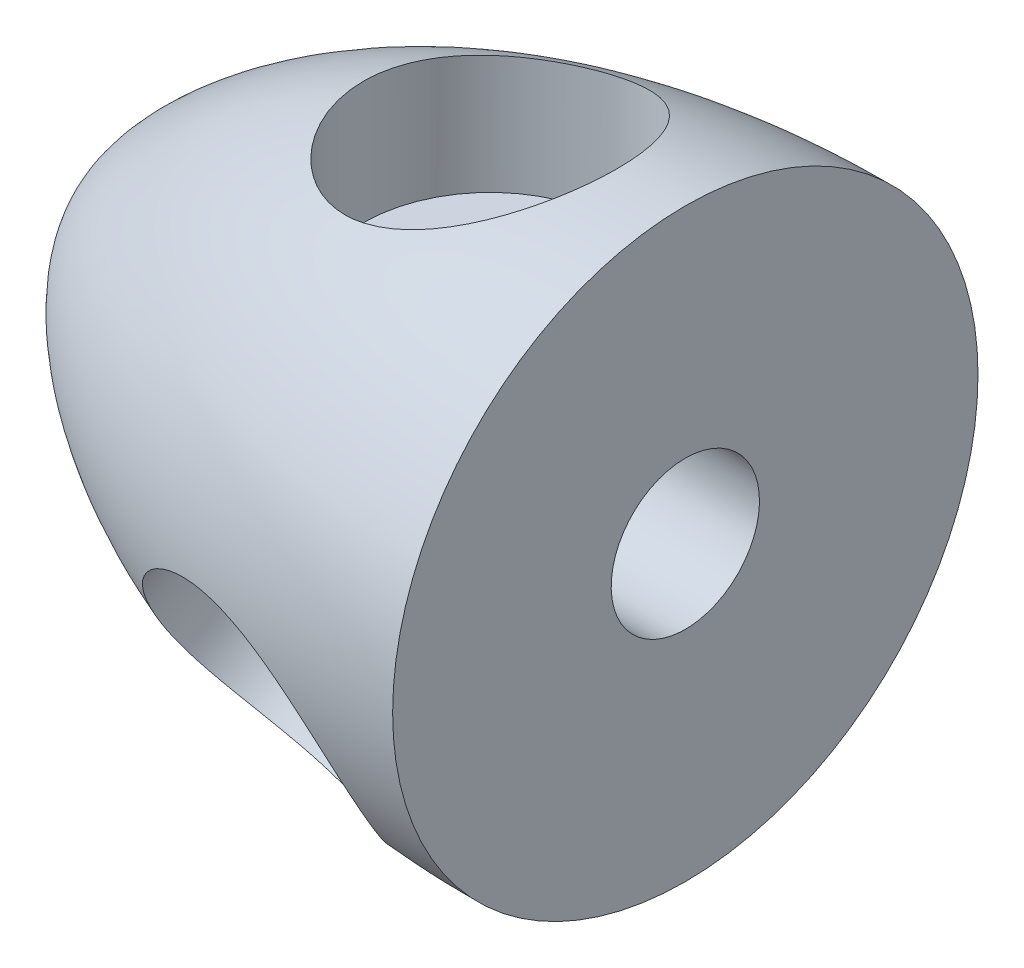
ISO-10303-21;
HEADER;
FILE_DESCRIPTION(('STEP AP214'),'2;1');
FILE_NAME('part.step','',(''),(''),'','','');
FILE_SCHEMA(('AUTOMOTIVE_DESIGN { 1 0 10303 214 1 1 1 1 }'));
ENDSEC;
DATA;
#1=APPLICATION_CONTEXT('core data for automotive mechanical design processes');
#2=APPLICATION_PROTOCOL_DEFINITION('international standard','automotive_design',2000,#1);
#3=PRODUCT_CONTEXT('',#1,'mechanical');
#4=PRODUCT('Part','Part','',(#3));
#5=PRODUCT_RELATED_PRODUCT_CATEGORY('part','',(#4));
#6=PRODUCT_DEFINITION_FORMATION('','',#4);
#7=PRODUCT_DEFINITION_CONTEXT('part definition',#1,'design');
#8=PRODUCT_DEFINITION('design','',#6,#7);
#9=PRODUCT_DEFINITION_SHAPE('','',#8);
#10=(LENGTH_UNIT() NAMED_UNIT(*) SI_UNIT(.MILLI.,.METRE.));
#11=(NAMED_UNIT(*) PLANE_ANGLE_UNIT() SI_UNIT($,.RADIAN.));
#12=(NAMED_UNIT(*) SI_UNIT($,.STERADIAN.) SOLID_ANGLE_UNIT());
#13=UNCERTAINTY_MEASURE_WITH_UNIT(LENGTH_MEASURE(1.E-05),#10,'distance_accuracy_value','');
#14=(GEOMETRIC_REPRESENTATION_CONTEXT(3) GLOBAL_UNCERTAINTY_ASSIGNED_CONTEXT((#13)) GLOBAL_UNIT_ASSIGNED_CONTEXT((#10,
#11,#12)) REPRESENTATION_CONTEXT('',''));
#15=CARTESIAN_POINT('',(0.,0.,0.));
#16=DIRECTION('',(0.,0.,1.));
#17=DIRECTION('',(1.,0.,0.));
#18=AXIS2_PLACEMENT_3D('',#15,#16,#17);
#19=CARTESIAN_POINT('',(0.,19.0500000000012,0.));
#20=CARTESIAN_POINT('',(-25.41,19.05,0.));
#21=CARTESIAN_POINT('',(-38.1,6.31666666666703,0.));
#22=CARTESIAN_POINT('',(-38.0999999999999,9.99200722162641E-13,0.));
#23=B_SPLINE_CURVE_WITH_KNOTS('',3,(#19,#20,#21,#22),.UNSPECIFIED.,.F.,.F.,(4,4),(0.,1.),.UNSPECIFIED.);
#24=CARTESIAN_POINT('',(0.,0.,0.));
#25=DIRECTION('',(1.,0.,0.));
#26=AXIS1_PLACEMENT('',#24,#25);
#27=SURFACE_OF_REVOLUTION('',#23,#26);
#28=CARTESIAN_POINT('',(-4.44500000000001,-9.45804617799617,16.3818165206235));
#29=CARTESIAN_POINT('',(-4.44500015064138,-9.27091519654826,16.4898565183917));
#30=CARTESIAN_POINT('',(-4.45349295522154,-9.08166766091949,16.5942355421234));
#31=CARTESIAN_POINT('',(-4.48736047476967,-8.7004214016924,16.7949134835629));
#32=CARTESIAN_POINT('',(-4.51273540002479,-8.50842264385346,16.8912123006051));
#33=CARTESIAN_POINT('',(-4.58006945896048,-8.1231496462918,17.0751618863486));
#34=CARTESIAN_POINT('',(-4.62203212616186,-7.92987514344122,17.1628108074744));
#35=CARTESIAN_POINT('',(-4.72205826379847,-7.54359727914573,17.3290286473111));
#36=CARTESIAN_POINT('',(-4.78012179030352,-7.3505939186474,17.4075975344002));
#37=CARTESIAN_POINT('',(-4.9115311197286,-6.96686715316216,17.5552101880287));
#38=CARTESIAN_POINT('',(-4.98483255345865,-6.7761387921417,17.6242806623933));
#39=CARTESIAN_POINT('',(-5.1460871324351,-6.39776467563141,17.7530936656805));
#40=CARTESIAN_POINT('',(-5.23404022095019,-6.21011890820884,17.812836230719));
#41=CARTESIAN_POINT('',(-5.42379490081363,-5.83918666210894,17.9230636609815));
#42=CARTESIAN_POINT('',(-5.52559570730404,-5.65589993706196,17.973549050501));
#43=CARTESIAN_POINT('',(-5.74225332795735,-5.29477608038795,18.0654742901383));
#44=CARTESIAN_POINT('',(-5.85711517467897,-5.11694108310611,18.1069106354801));
#45=CARTESIAN_POINT('',(-6.1053454161345,-4.75874289049157,18.182931272827));
#46=CARTESIAN_POINT('',(-6.23936664946179,-4.57873174657534,18.217045362668));
#47=CARTESIAN_POINT('',(-6.51995154640287,-4.22711831765983,18.2759689457253));
#48=CARTESIAN_POINT('',(-6.66651981102178,-4.05551915392863,18.3007750075757));
#49=CARTESIAN_POINT('',(-7.12359872561892,-3.55500968992728,18.3619113119326));
#50=CARTESIAN_POINT('',(-7.45162087673701,-3.2401897065755,18.3850001954523));
#51=CARTESIAN_POINT('',(-8.17985496598698,-2.62887020260287,18.400629367394));
#52=CARTESIAN_POINT('',(-8.58395898517171,-2.33690931780023,18.3900784498721));
#53=CARTESIAN_POINT('',(-9.21815712200873,-1.947698950637,18.350544957651));
#54=CARTESIAN_POINT('',(-9.43439404481089,-1.82601479463142,18.3333952807613));
#55=CARTESIAN_POINT('',(-9.87509355403064,-1.60008903435713,18.2918811048565));
#56=CARTESIAN_POINT('',(-10.0995527835617,-1.49584040640996,18.2675195220734));
#57=CARTESIAN_POINT('',(-10.5618609071371,-1.30330535203921,18.2114842391681));
#58=CARTESIAN_POINT('',(-10.7999088571543,-1.2155509710715,18.1796239802564));
#59=CARTESIAN_POINT('',(-11.2817417100073,-1.06104100821833,18.1097176756852));
#60=CARTESIAN_POINT('',(-11.5255240417092,-0.994276201076428,18.0716743587639));
#61=CARTESIAN_POINT('',(-12.0171307659768,-0.882889259018609,17.9900582918136));
#62=CARTESIAN_POINT('',(-12.264954028781,-0.838261041193929,17.946487064935));
#63=CARTESIAN_POINT('',(-12.762758223985,-0.772129307192009,17.8543949701456));
#64=CARTESIAN_POINT('',(-13.0127389638025,-0.75062374810978,17.8058745399156));
#65=CARTESIAN_POINT('',(-13.4960310767581,-0.732108514416318,17.7077636215655));
#66=CARTESIAN_POINT('',(-13.7293423396882,-0.733560873433298,17.6584602870194));
#67=CARTESIAN_POINT('',(-14.194093327426,-0.757566821073084,17.5562802924741));
#68=CARTESIAN_POINT('',(-14.4255331309278,-0.780119517731194,17.5034037836098));
#69=CARTESIAN_POINT('',(-14.884490616024,-0.846316353548636,17.3943025763769));
#70=CARTESIAN_POINT('',(-15.1120096410373,-0.889953113398031,17.3380790554767));
#71=CARTESIAN_POINT('',(-15.5612127620297,-0.997969601659725,17.2223592465344));
#72=CARTESIAN_POINT('',(-15.7828971051644,-1.06234844990773,17.162863097451));
#73=CARTESIAN_POINT('',(-16.2033746376248,-1.20599190434333,17.0448151211586));
#74=CARTESIAN_POINT('',(-16.4026894612292,-1.28391548793583,16.9864836620922));
#75=CARTESIAN_POINT('',(-16.7930856863612,-1.45632309745679,16.8668606280036));
#76=CARTESIAN_POINT('',(-16.9841675288754,-1.55080623502155,16.8055692119007));
#77=CARTESIAN_POINT('',(-17.3567322231473,-1.75534651725223,16.6798475063256));
#78=CARTESIAN_POINT('',(-17.5382144229241,-1.8654047178717,16.6154170042249));
#79=CARTESIAN_POINT('',(-17.890309240859,-2.09994416389083,16.4831948118098));
#80=CARTESIAN_POINT('',(-18.0609215789454,-2.22442578069001,16.4154030349691));
#81=CARTESIAN_POINT('',(-18.3913863475528,-2.48754684959384,16.2756767827332));
#82=CARTESIAN_POINT('',(-18.5511470939272,-2.62628676104388,16.2037147258324));
#83=CARTESIAN_POINT('',(-18.8574971658255,-2.91582389827507,16.0558258207199));
#84=CARTESIAN_POINT('',(-19.0040806059013,-3.06662645539032,15.9798972246151));
#85=CARTESIAN_POINT('',(-19.2830812756176,-3.37883589353541,15.8238507548588));
#86=CARTESIAN_POINT('',(-19.4154966594329,-3.54024415187333,15.7437323373735));
#87=CARTESIAN_POINT('',(-19.6652514859611,-3.87212389886682,15.5791542148311));
#88=CARTESIAN_POINT('',(-19.7825971611242,-4.04259159925765,15.4946963248357));
#89=CARTESIAN_POINT('',(-20.0054540661015,-4.39742435592024,15.318178058372));
#90=CARTESIAN_POINT('',(-20.1103918521493,-4.58206840694361,15.2259538055678));
#91=CARTESIAN_POINT('',(-20.3026418377118,-4.95792935434696,15.0366453165367));
#92=CARTESIAN_POINT('',(-20.3899536433146,-5.14914639751078,14.9395609717552));
#93=CARTESIAN_POINT('',(-20.5463296088185,-5.5365017758237,14.7406331882602));
#94=CARTESIAN_POINT('',(-20.6153940571947,-5.73264003311892,14.6387898248128));
#95=CARTESIAN_POINT('',(-20.734771311653,-6.1282010819664,14.4305915532092));
#96=CARTESIAN_POINT('',(-20.7850842677316,-6.32762384723198,14.324236681149));
#97=CARTESIAN_POINT('',(-20.8666686018481,-6.72857277370498,14.107191267698));
#98=CARTESIAN_POINT('',(-20.8978989088364,-6.93010252884776,13.9964919165699));
#99=CARTESIAN_POINT('',(-20.940907263956,-7.33326399762503,13.7715529420818));
#100=CARTESIAN_POINT('',(-20.9526852423562,-7.5348957116224,13.6573133060324));
#101=CARTESIAN_POINT('',(-20.9566967260985,-7.93673729818704,13.4260474242201));
#102=CARTESIAN_POINT('',(-20.9489311931396,-8.13694724023081,13.3090213158549));
#103=CARTESIAN_POINT('',(-20.9139183015301,-8.53453008101243,13.0730830631509));
#104=CARTESIAN_POINT('',(-20.8866710785033,-8.73190299949075,12.9541709319475));
#105=CARTESIAN_POINT('',(-20.8132940729264,-9.12044313565206,12.7167645860496));
#106=CARTESIAN_POINT('',(-20.7673656108476,-9.31165375808096,12.5982790985949));
#107=CARTESIAN_POINT('',(-20.6569828933475,-9.6888509311007,12.361628313286));
#108=CARTESIAN_POINT('',(-20.5925287601442,-9.87483751614677,12.2434630133245));
#109=CARTESIAN_POINT('',(-20.4455532657253,-10.2405714769516,12.0086815284333));
#110=CARTESIAN_POINT('',(-20.3630300556727,-10.4203182120639,11.8920655033222));
#111=CARTESIAN_POINT('',(-20.1804991902111,-10.7726412135588,11.6617198102237));
#112=CARTESIAN_POINT('',(-20.0804913406838,-10.9452174003062,11.5479901742977));
#113=CARTESIAN_POINT('',(-19.8627060122151,-11.2839043774029,11.3238130954277));
#114=CARTESIAN_POINT('',(-19.744777890609,-11.4499437085208,11.2134040102167));
#115=CARTESIAN_POINT('',(-19.4925649089392,-11.7732638030245,10.9983703973952));
#116=CARTESIAN_POINT('',(-19.3582725311354,-11.9305404921369,10.89374856078));
#117=CARTESIAN_POINT('',(-19.0742743837781,-12.2356293239645,10.6918452871486));
#118=CARTESIAN_POINT('',(-18.9245676902412,-12.3834408984479,10.5945642907723));
#119=CARTESIAN_POINT('',(-18.610844469357,-12.6689556808042,10.408902382752));
#120=CARTESIAN_POINT('',(-18.4468347951823,-12.806663672129,10.320517251973));
#121=CARTESIAN_POINT('',(-18.1052636830487,-13.0717901659123,10.1539080311));
#122=CARTESIAN_POINT('',(-17.927676936145,-13.1991884934935,10.0757036900389));
#123=CARTESIAN_POINT('',(-17.5605196939864,-13.442928101796,9.93105919836899));
#124=CARTESIAN_POINT('',(-17.3709491751156,-13.5592693607265,9.86461907094438));
#125=CARTESIAN_POINT('',(-16.9813281129981,-13.7804226889622,9.74479602428202));
#126=CARTESIAN_POINT('',(-16.7812808631909,-13.8852383496902,9.69140903125441));
#127=CARTESIAN_POINT('',(-16.3722429271608,-14.0829821135884,9.59875076199868));
#128=CARTESIAN_POINT('',(-16.1632525545809,-14.1759106331955,9.55947899119106));
#129=CARTESIAN_POINT('',(-15.7453007172321,-14.3465674639179,9.49697029216099));
#130=CARTESIAN_POINT('',(-15.5365815956366,-14.4247062387361,9.4732319477776));
#131=CARTESIAN_POINT('',(-15.114021683305,-14.5693028633445,9.44019354772077));
#132=CARTESIAN_POINT('',(-14.9001810203412,-14.6357610041991,9.43089313222982));
#133=CARTESIAN_POINT('',(-14.4690461224957,-14.756783267086,9.42694492532753));
#134=CARTESIAN_POINT('',(-14.2517521056408,-14.8113481368217,9.43229621250925));
#135=CARTESIAN_POINT('',(-13.8153354536472,-14.9084382610643,9.4575833873341));
#136=CARTESIAN_POINT('',(-13.5962128100326,-14.9509634597324,9.47751934261781));
#137=CARTESIAN_POINT('',(-13.1605691496248,-15.0234042157436,9.53129632939343));
#138=CARTESIAN_POINT('',(-12.9440513126238,-15.053476397171,9.56495336926101));
#139=CARTESIAN_POINT('',(-12.5121968988408,-15.1017520947654,9.64562612620604));
#140=CARTESIAN_POINT('',(-12.2968603056443,-15.1199557762728,9.69264165717302));
#141=CARTESIAN_POINT('',(-11.8686641134685,-15.1444823186695,9.79933560931498));
#142=CARTESIAN_POINT('',(-11.6558045878,-15.1508048288095,9.85901440427));
#143=CARTESIAN_POINT('',(-11.233677908874,-15.1515771760508,9.99023378954572));
#144=CARTESIAN_POINT('',(-11.0244121668816,-15.1460224518268,10.0617789272758));
#145=CARTESIAN_POINT('',(-10.5982329829628,-15.1223570634402,10.2204263517716));
#146=CARTESIAN_POINT('',(-10.3816103413817,-15.1035155615932,10.3082030232261));
#147=CARTESIAN_POINT('',(-9.95480454693141,-15.0525213606554,10.4949226311428));
#148=CARTESIAN_POINT('',(-9.74462384544612,-15.020363660203,10.593869752889));
#149=CARTESIAN_POINT('',(-9.12540366213247,-14.90392007834,10.9057111736962));
#150=CARTESIAN_POINT('',(-8.72745216734617,-14.7996508682317,11.1336941652255));
#151=CARTESIAN_POINT('',(-7.9401561230391,-14.5275273293755,11.6391488390151));
#152=CARTESIAN_POINT('',(-7.55386150630596,-14.3553763512253,11.9190850986017));
#153=CARTESIAN_POINT('',(-7.01501740365332,-14.0509679382437,12.3562883474143));
#154=CARTESIAN_POINT('',(-6.84206340926645,-13.9417098472729,12.5050148265873));
#155=CARTESIAN_POINT('',(-6.51092269081989,-13.7078535015912,12.8067219431345));
#156=CARTESIAN_POINT('',(-6.35272931990797,-13.5832622107558,12.9597006250267));
#157=CARTESIAN_POINT('',(-6.05232553404148,-13.3188696262139,13.2683898261292));
#158=CARTESIAN_POINT('',(-5.9101230807821,-13.1790608234551,13.4241016619331));
#159=CARTESIAN_POINT('',(-5.64319037033683,-12.8847184320576,13.7364325179549));
#160=CARTESIAN_POINT('',(-5.51845206412011,-12.7301916823032,13.8930510853795));
#161=CARTESIAN_POINT('',(-5.28780376423315,-12.4070670282233,14.2053971542461));
#162=CARTESIAN_POINT('',(-5.18188167305356,-12.2384782680103,14.3611251654581));
#163=CARTESIAN_POINT('',(-4.99007923779726,-11.8880324980337,14.6699565329968));
#164=CARTESIAN_POINT('',(-4.90419517383647,-11.7061779591868,14.8230603715806));
#165=CARTESIAN_POINT('',(-4.7658531307572,-11.360920137167,15.1002994546568));
#166=CARTESIAN_POINT('',(-4.71023234173758,-11.1993128887385,15.2251031499263));
#167=CARTESIAN_POINT('',(-4.6144393610873,-10.8685210402634,15.4705096453304));
#168=CARTESIAN_POINT('',(-4.5742651270914,-10.6993374452769,15.5911129989211));
#169=CARTESIAN_POINT('',(-4.50981515701819,-10.3544842382264,15.8270618149237));
#170=CARTESIAN_POINT('',(-4.48553409403636,-10.1788168202169,15.942409026961));
#171=CARTESIAN_POINT('',(-4.45312609844276,-9.82212357046954,16.1669442035897));
#172=CARTESIAN_POINT('',(-4.44499985264278,-9.64109751124458,16.2761319061218));
#173=CARTESIAN_POINT('',(-4.44500000000001,-9.45804617799617,16.3818165206235));
#174=B_SPLINE_CURVE_WITH_KNOTS('',3,(#28,#29,#30,#31,#32,#33,#34,#35,#36,#37,#38,#39,#40,#41,
#42,#43,#44,#45,#46,#47,#48,#49,#50,#51,#52,#53,#54,#55,#56,#57,#58,#59,#60,#61,#62,#63,#64,#65,
#66,#67,#68,#69,#70,#71,#72,#73,#74,#75,#76,#77,#78,#79,#80,#81,#82,#83,#84,#85,#86,#87,#88,#89,
#90,#91,#92,#93,#94,#95,#96,#97,#98,#99,#100,#101,#102,#103,#104,#105,#106,#107,#108,#109,#110,
#111,#112,#113,#114,#115,#116,#117,#118,#119,#120,#121,#122,#123,#124,#125,#126,#127,#128,#129,
#130,#131,#132,#133,#134,#135,#136,#137,#138,#139,#140,#141,#142,#143,#144,#145,#146,#147,#148,
#149,#150,#151,#152,#153,#154,#155,#156,#157,#158,#159,#160,#161,#162,#163,#164,#165,#166,#167,
#168,#169,#170,#171,#172,#173),.UNSPECIFIED.,.T.,.F.,(4,2,2,2,2,2,2,2,2,2,2,2,2,2,2,2,2,2,2,2,2,
2,2,2,2,2,2,2,2,2,2,2,2,2,2,2,2,2,2,2,2,2,2,2,2,2,2,2,2,2,2,2,2,2,2,2,2,2,2,2,2,2,2,2,2,2,2,2,2,
2,2,2,4),(0.,0.648037965160109,1.29608400256488,1.94426816119365,2.59245457709501,
3.23877941979629,3.8851017599822,4.53138748330386,5.17792307668567,5.85818570541619,
6.53869886434002,7.89900067392553,9.38777986307498,10.133231005912,10.8783811262419,
11.644510653493,12.4103029821674,13.1758847621895,13.9413988969029,14.6558614950964,
15.3702938925116,16.0844764233167,16.7986286526796,17.4632823101108,18.1279003220438,
18.7925634151599,19.4572436269968,20.1269781102167,20.7970102494557,21.4671295749722,
22.1369708573915,22.83077178957,23.5245882253452,24.2183936918191,24.9121936083026,
25.607481558928,26.30277200196,26.9980282317426,27.693279621472,28.3812290994271,
29.0691740389313,29.7571894022253,30.4452124045026,31.139376653854,31.8338610131525,
32.5283870263346,33.2225820716602,33.9181042863071,34.6136278716309,35.3089341111467,
36.0042159856371,36.6757734617708,37.3473142012924,38.0188127103582,38.6903143337103,
39.3530931188825,40.0158626706742,40.6786517880764,41.3416954882981,42.0443811946336,
42.7473310587455,44.1524876396915,45.66639780264,46.424402680831,47.1820645578807,
47.9401020113443,48.6977889355153,49.4549869429122,50.2120442710937,50.8462239118206,
51.4803196715638,52.1142027928383,52.7481128626744),.UNSPECIFIED.);
#175=CARTESIAN_POINT('',(-4.44500000000001,-9.45804617799617,16.3818165206235));
#176=VERTEX_POINT('',#175);
#177=EDGE_CURVE('E107',#176,#176,#174,.T.);
#178=ORIENTED_EDGE('',*,*,#177,.F.);
#179=EDGE_LOOP('',(#178));
#180=FACE_BOUND('',#179,.T.);
#181=CARTESIAN_POINT('',(-4.44499999999993,-9.45804617799595,-16.3818165206237));
#182=CARTESIAN_POINT('',(-4.44500015064126,-9.6451770514121,-16.2737763357388));
#183=CARTESIAN_POINT('',(-4.45349295522142,-9.83019570540029,-16.1620726741463));
#184=CARTESIAN_POINT('',(-4.48736047476953,-10.1946110302796,-15.9322426992774));
#185=CARTESIAN_POINT('',(-4.51273540002464,-10.3740076311122,-15.814116306015));
#186=CARTESIAN_POINT('',(-4.58006945896026,-10.7259491441626,-15.572434895606));
#187=CARTESIAN_POINT('',(-4.62203212616161,-10.8984925878971,-15.4488787267964));
#188=CARTESIAN_POINT('',(-4.72205826379833,-11.235580391906,-15.1974612033155));
#189=CARTESIAN_POINT('',(-4.78012179030352,-11.4001247243218,-15.0695998336532));
#190=CARTESIAN_POINT('',(-4.91153111972861,-11.7198244150268,-14.8110890334451));
#191=CARTESIAN_POINT('',(-4.98483255345851,-11.8750053809879,-14.6804486647611));
#192=CARTESIAN_POINT('',(-5.14608713243485,-12.1757477724274,-14.4171735693719));
#193=CARTESIAN_POINT('',(-5.23404022095,-12.3213092351494,-14.2845388503907));
#194=CARTESIAN_POINT('',(-5.42379490081343,-12.6022351130005,-14.0184158173167));
#195=CARTESIAN_POINT('',(-5.5255957073038,-12.7376001053679,-13.8849275520093));
#196=CARTESIAN_POINT('',(-5.74225332795719,-12.9977716264798,-13.6181477380357));
#197=CARTESIAN_POINT('',(-5.85711517467894,-13.1225740528267,-13.4848562853786));
#198=CARTESIAN_POINT('',(-6.10534541613446,-13.3675089522883,-13.2126578696583));
#199=CARTESIAN_POINT('',(-6.2393666494616,-13.4870581926757,-13.0738206909829));
#200=CARTESIAN_POINT('',(-6.51995154640247,-13.7138942269431,-12.798776320759));
#201=CARTESIAN_POINT('',(-6.66651981102131,-13.8211764885389,-12.6625701166248));
#202=CARTESIAN_POINT('',(-7.12359872561856,-14.1243768132059,-12.2596843581437));
#203=CARTESIAN_POINT('',(-7.45162087673707,-14.3017823645542,-11.9985866967022));
#204=CARTESIAN_POINT('',(-8.17985496598714,-14.6209773764822,-11.4769830624038));
#205=CARTESIAN_POINT('',(-8.58395898517147,-14.7578204562772,-11.2188620604921));
#206=CARTESIAN_POINT('',(-9.21815712200841,-14.9181886312953,-10.8620292490017));
#207=CARTESIAN_POINT('',(-9.43439404481061,-14.9641786534448,-10.7480728402179));
#208=CARTESIAN_POINT('',(-9.87509355403052,-15.0411892026313,-10.5316583044987));
#209=CARTESIAN_POINT('',(-10.0995527835617,-15.0722157670384,-10.4291955529955));
#210=CARTESIAN_POINT('',(-10.5618609071371,-15.1199553157196,-10.2344376633387));
#211=CARTESIAN_POINT('',(-10.7999088571543,-15.1362407126147,-10.1425100106713));
#212=CARTESIAN_POINT('',(-11.2817417100072,-15.1529550583979,-9.97374730541689));
#213=CARTESIAN_POINT('',(-11.5255240417091,-15.1533909830708,-9.89690562789269));
#214=CARTESIAN_POINT('',(-12.0171307659767,-15.1384028667637,-9.75963367294552));
#215=CARTESIAN_POINT('',(-12.2649540287809,-15.1229831863252,-9.6991988891443));
#216=CARTESIAN_POINT('',(-12.7627582239849,-15.0762949597508,-9.59588108010797));
#217=CARTESIAN_POINT('',(-13.0127389638024,-15.04502781411,-9.55299650450564));
#218=CARTESIAN_POINT('',(-13.4960310767581,-14.9693188832769,-9.48790638259497));
#219=CARTESIAN_POINT('',(-13.7293423396883,-14.9258947635603,-9.46451249512558));
#220=CARTESIAN_POINT('',(-14.1940933274261,-14.8254013187057,-9.43421225835064));
#221=CARTESIAN_POINT('',(-14.4255331309279,-14.7683325704367,-9.42730521214841));
#222=CARTESIAN_POINT('',(-14.8844906160241,-14.6407497354808,-9.43008275));
#223=CARTESIAN_POINT('',(-15.1120096410376,-14.5702403581665,-9.43976153211816));
#224=CARTESIAN_POINT('',(-15.5612127620298,-14.41601581977,-9.47544665050954));
#225=CARTESIAN_POINT('',(-15.7828971051642,-14.3323012191117,-9.50145229401745));
#226=CARTESIAN_POINT('',(-16.2033746376247,-14.1582469455593,-9.5668271864998));
#227=CARTESIAN_POINT('',(-16.4026894612294,-14.0687686283724,-9.60514525991125));
#228=CARTESIAN_POINT('',(-16.7930856863616,-13.8789682372139,-9.69464311251757));
#229=CARTESIAN_POINT('',(-16.9841675288757,-13.7786467450523,-9.74582220182658));
#230=CARTESIAN_POINT('',(-17.3567322231474,-13.5674984131017,-9.86009842954807));
#231=CARTESIAN_POINT('',(-17.5382144229242,-13.4566708611943,-9.92319637612893));
#232=CARTESIAN_POINT('',(-17.8903092408591,-13.2248933606093,-10.0602023983635));
#233=CARTESIAN_POINT('',(-18.0609215789454,-13.1039431512981,-10.1341107523955));
#234=CARTESIAN_POINT('',(-18.3913863475529,-12.8513761328342,-10.2921171562192));
#235=CARTESIAN_POINT('',(-18.5511470939273,-12.7196852077245,-10.3762884156032));
#236=CARTESIAN_POINT('',(-18.8574971658255,-12.4468410903435,-10.5530904792282));
#237=CARTESIAN_POINT('',(-19.0040806059014,-12.3056837186854,-10.6457250265934));
#238=CARTESIAN_POINT('',(-19.2830812756178,-12.014438792633,-10.8380830964501));
#239=CARTESIAN_POINT('',(-19.4154966594331,-11.8643500786106,-10.9378075398085));
#240=CARTESIAN_POINT('',(-19.6652514859612,-11.555881370085,-11.1429347704356));
#241=CARTESIAN_POINT('',(-19.7825971611241,-11.3975048416036,-11.2483351845016));
#242=CARTESIAN_POINT('',(-20.0054540661014,-11.0672191602828,-11.4673702326345));
#243=CARTESIAN_POINT('',(-20.1103918521495,-10.8950285889975,-11.5811645450758));
#244=CARTESIAN_POINT('',(-20.3026418377121,-10.5431521546427,-11.8120154293017));
#245=CARTESIAN_POINT('',(-20.3899536433148,-10.3634661241702,-11.9290720739274));
#246=CARTESIAN_POINT('',(-20.5463296088186,-9.99751192098865,-12.1650677800916));
#247=CARTESIAN_POINT('',(-20.6153940571948,-9.81124385238874,-12.2840068118395));
#248=CARTESIAN_POINT('',(-20.734771311653,-9.43315833573222,-12.5224735930871));
#249=CARTESIAN_POINT('',(-20.7850842677315,-9.24134093207895,-12.6420013378698));
#250=CARTESIAN_POINT('',(-20.866668601848,-8.85289962701893,-12.88071058709));
#251=CARTESIAN_POINT('',(-20.8978989088363,-8.65626629918821,-12.9998907990982));
#252=CARTESIAN_POINT('',(-20.940907263956,-8.25988269859165,-13.2365693856425));
#253=CARTESIAN_POINT('',(-20.9526852423562,-8.060132414655,-13.3540677541481));
#254=CARTESIAN_POINT('',(-20.9566967260984,-7.65892949269451,-13.586439835504));
#255=CARTESIAN_POINT('',(-20.9489311931394,-7.4574769389223,-13.7013136772215));
#256=CARTESIAN_POINT('',(-20.91391830153,-7.05435699796524,-13.9276613910952));
#257=CARTESIAN_POINT('',(-20.8866710785034,-6.85268961228572,-14.0391352869149));
#258=CARTESIAN_POINT('',(-20.8132940729264,-6.45281961763791,-14.2569177422714));
#259=CARTESIAN_POINT('',(-20.7673656108474,-6.25460286430806,-14.3632682550408));
#260=CARTESIAN_POINT('',(-20.6569828933472,-5.8610586858953,-14.571605196457));
#261=CARTESIAN_POINT('',(-20.592528760144,-5.66573124175991,-14.6735916538892));
#262=CARTESIAN_POINT('',(-20.4455532657252,-5.27953753110361,-14.8729358125272));
#263=CARTESIAN_POINT('',(-20.3630300556727,-5.08867172331299,-14.970293038826));
#264=CARTESIAN_POINT('',(-20.1804991902111,-4.71302500069016,-15.160240861909));
#265=CARTESIAN_POINT('',(-20.0804913406838,-4.52824415344159,-15.2528314057577));
#266=CARTESIAN_POINT('',(-19.8627060122151,-4.16475761964569,-15.4340543924193));
#267=CARTESIAN_POINT('',(-19.744777890609,-3.98612088148513,-15.5226441285892));
#268=CARTESIAN_POINT('',(-19.4925649089392,-3.63823626286212,-15.6951307375725));
#269=CARTESIAN_POINT('',(-19.3582725311353,-3.46899275000655,-15.7790254274594));
#270=CARTESIAN_POINT('',(-19.074274383778,-3.14159497002074,-15.9422884694173));
#271=CARTESIAN_POINT('',(-18.9245676902409,-2.98344136861171,-16.0216565497052));
#272=CARTESIAN_POINT('',(-18.6108444693568,-2.67989604857262,-16.1760886503716));
#273=CARTESIAN_POINT('',(-18.4468347951823,-2.53449828433859,-16.2511547037735));
#274=CARTESIAN_POINT('',(-18.1052636830486,-2.25764721966626,-16.3974563721697));
#275=CARTESIAN_POINT('',(-17.9276769361448,-2.12622110983075,-16.468684389724));
#276=CARTESIAN_POINT('',(-17.5605196939861,-1.87908550137605,-16.6074468365875));
#277=CARTESIAN_POINT('',(-17.3709491751154,-1.76337603373035,-16.6749812586173));
#278=CARTESIAN_POINT('',(-16.981328112998,-1.549029567244,-16.8065941356696));
#279=CARTESIAN_POINT('',(-16.7812808631907,-1.45038724468644,-16.8706736640606));
#280=CARTESIAN_POINT('',(-16.3722429271607,-1.27127094769126,-16.9955956524088));
#281=CARTESIAN_POINT('',(-16.1632525545809,-1.19079633671679,-17.0564382257214));
#282=CARTESIAN_POINT('',(-15.7453007172322,-1.05133380003805,-17.1729770269412));
#283=CARTESIAN_POINT('',(-15.5365815956365,-0.991706403349072,-17.2287780187622));
#284=CARTESIAN_POINT('',(-15.1140216833048,-0.89079599729519,-17.3374831689458));
#285=CARTESIAN_POINT('',(-14.900181020341,-0.84951253078695,-17.3903873994688));
#286=CARTESIAN_POINT('',(-14.4690461224956,-0.785582151866796,-17.4932216501013));
#287=CARTESIAN_POINT('',(-14.2517521056406,-0.762934067641329,-17.5431518570373));
#288=CARTESIAN_POINT('',(-13.8153354536471,-0.736288341308122,-17.6398779585005));
#289=CARTESIAN_POINT('',(-13.5962128100325,-0.732290785698182,-17.6866738384902));
#290=CARTESIAN_POINT('',(-13.1605691496247,-0.742642644379279,-17.776297866853));
#291=CARTESIAN_POINT('',(-12.9440513126237,-0.756754405207357,-17.8191696598499));
#292=CARTESIAN_POINT('',(-12.5121968988407,-0.802481213318067,-17.9013140188245));
#293=CARTESIAN_POINT('',(-12.2968603056443,-0.834096016754153,-17.9405866349358));
#294=CARTESIAN_POINT('',(-11.8686641134684,-0.914232418540785,-18.0151742197894));
#295=CARTESIAN_POINT('',(-11.6558045877999,-0.962754515969032,-18.0504890716637));
#296=CARTESIAN_POINT('',(-11.2336779088739,-1.07600766346638,-18.1167676366332));
#297=CARTESIAN_POINT('',(-11.0244121668816,-1.14074493237027,-18.1477296732094));
#298=CARTESIAN_POINT('',(-10.5982329829628,-1.28997032642198,-18.206558557924));
#299=CARTESIAN_POINT('',(-10.3816103413815,-1.37540790468427,-18.2341296744062));
#300=CARTESIAN_POINT('',(-9.95480454693113,-1.56260892899348,-18.2833272049066));
#301=CARTESIAN_POINT('',(-9.74462384544589,-1.66437850028333,-18.3049513802607));
#302=CARTESIAN_POINT('',(-9.12540366213236,-1.99266288358623,-18.3600289906634));
#303=CARTESIAN_POINT('',(-8.72745216734609,-2.24223655093544,-18.3837207016419));
#304=CARTESIAN_POINT('',(-7.9401561230391,-2.8160349083268,-18.4007821409195));
#305=CARTESIAN_POINT('',(-7.55386150630598,-3.14454230964424,-18.3916631503482));
#306=CARTESIAN_POINT('',(-7.01501740365347,-3.67537563622379,-18.3466393559868));
#307=CARTESIAN_POINT('',(-6.84206340926665,-3.85880559088844,-18.3263823132235));
#308=CARTESIAN_POINT('',(-6.51092269082003,-4.2370197911616,-18.2747103353007));
#309=CARTESIAN_POINT('',(-6.35272931990799,-4.43179886133524,-18.2433004532931));
#310=CARTESIAN_POINT('',(-6.05232553404151,-4.83132784363481,-18.1686743590588));
#311=CARTESIAN_POINT('',(-5.91012308078226,-5.03608265049044,-18.1254523020989));
#312=CARTESIAN_POINT('',(-5.64319037033708,-5.45374030188982,-18.0267097417489));
#313=CARTESIAN_POINT('',(-5.51845206412029,-5.66663933486107,-17.9711949346097));
#314=CARTESIAN_POINT('',(-5.28780376423329,-6.0987012923117,-17.8475338100208));
#315=CARTESIAN_POINT('',(-5.18188167305374,-6.31786008620865,-17.7793956664898));
#316=CARTESIAN_POINT('',(-4.99007923779733,-6.76053878097093,-17.6303164108106));
#317=CARTESIAN_POINT('',(-4.90419517383641,-6.98405786402482,-17.5493776796677));
#318=CARTESIAN_POINT('',(-4.76585313075716,-7.39678286390059,-17.3889951764814));
#319=CARTESIAN_POINT('',(-4.71023234173765,-7.58566965870426,-17.3114410415414));
#320=CARTESIAN_POINT('',(-4.61443936108744,-7.96359384221541,-17.1476701450993));
#321=CARTESIAN_POINT('',(-4.5742651270915,-8.15263120769981,-17.0614545307328));
#322=CARTESIAN_POINT('',(-4.50981515701826,-8.52939547987598,-16.8807773008518));
#323=CARTESIAN_POINT('',(-4.48553409403642,-8.71712280476067,-16.786318460257));
#324=CARTESIAN_POINT('',(-4.45312609844277,-9.08992259663803,-16.589680632932));
#325=CARTESIAN_POINT('',(-4.44499985264273,-9.27499495042421,-16.4875013181625));
#326=CARTESIAN_POINT('',(-4.44499999999993,-9.45804617799595,-16.3818165206237));
#327=B_SPLINE_CURVE_WITH_KNOTS('',3,(#181,#182,#183,#184,#185,#186,#187,#188,#189,#190,#191,
#192,#193,#194,#195,#196,#197,#198,#199,#200,#201,#202,#203,#204,#205,#206,#207,#208,#209,#210,
#211,#212,#213,#214,#215,#216,#217,#218,#219,#220,#221,#222,#223,#224,#225,#226,#227,#228,#229,
#230,#231,#232,#233,#234,#235,#236,#237,#238,#239,#240,#241,#242,#243,#244,#245,#246,#247,#248,
#249,#250,#251,#252,#253,#254,#255,#256,#257,#258,#259,#260,#261,#262,#263,#264,#265,#266,#267,
#268,#269,#270,#271,#272,#273,#274,#275,#276,#277,#278,#279,#280,#281,#282,#283,#284,#285,#286,
#287,#288,#289,#290,#291,#292,#293,#294,#295,#296,#297,#298,#299,#300,#301,#302,#303,#304,#305,
#306,#307,#308,#309,#310,#311,#312,#313,#314,#315,#316,#317,#318,#319,#320,#321,#322,#323,#324,
#325,#326),.UNSPECIFIED.,.T.,.F.,(4,2,2,2,2,2,2,2,2,2,2,2,2,2,2,2,2,2,2,2,2,2,2,2,2,2,2,2,2,2,2,
2,2,2,2,2,2,2,2,2,2,2,2,2,2,2,2,2,2,2,2,2,2,2,2,2,2,2,2,2,2,2,2,2,2,2,2,2,2,2,2,2,4),(0.,
0.648037965160295,1.29608400256528,1.94426816119427,2.59245457709584,3.23877941979718,
3.88510175998316,4.53138748330483,5.17792307668669,5.85818570541707,6.53869886434069,
7.89900067392597,9.38777986307578,10.1332310059128,10.8783811262429,11.644510653494,
12.4103029821684,13.1758847621904,13.9413988969039,14.6558614950975,15.3702938925127,
16.0844764233178,16.798628652681,17.4632823101122,18.127900322045,18.7925634151609,
19.4572436269978,20.1269781102177,20.7970102494569,21.4671295749735,22.136970857393,
22.8307717895715,23.5245882253466,24.2183936918205,24.9121936083039,25.6074815589295,
26.3027720019616,26.9980282317444,27.6932796214739,28.3812290994286,29.0691740389325,
29.7571894022261,30.4452124045032,31.1393766538548,31.8338610131535,32.5283870263358,
33.2225820716614,33.9181042863083,34.6136278716319,35.3089341111477,36.004215985638,
36.6757734617718,37.3473142012935,38.0188127103592,38.6903143337112,39.3530931188834,
40.0158626706752,40.6786517880774,41.3416954882992,42.0443811946348,42.7473310587465,
44.1524876396925,45.6663978026407,46.4244026808316,47.1820645578812,47.9401020113448,
48.6977889355158,49.4549869429127,50.2120442710943,50.8462239118209,51.480319671564,
52.1142027928382,52.7481128626741),.UNSPECIFIED.);
#328=CARTESIAN_POINT('',(-4.44499999999993,-9.45804617799595,-16.3818165206237));
#329=VERTEX_POINT('',#328);
#330=EDGE_CURVE('E95',#329,#329,#327,.T.);
#331=ORIENTED_EDGE('',*,*,#330,.F.);
#332=EDGE_LOOP('',(#331));
#333=FACE_BOUND('',#332,.T.);
#334=CARTESIAN_POINT('',(-4.44499999999997,18.9160923559953,0.));
#335=CARTESIAN_POINT('',(-4.44500015064132,18.9160922479635,-0.216080182653187));
#336=CARTESIAN_POINT('',(-4.45349295522143,18.9118633663225,-0.432162867977149));
#337=CARTESIAN_POINT('',(-4.48736047476952,18.8950324319745,-0.862670784285317));
#338=CARTESIAN_POINT('',(-4.51273540002464,18.8824302749681,-1.07709599459002));
#339=CARTESIAN_POINT('',(-4.58006945896024,18.8490987904568,-1.50272699074233));
#340=CARTESIAN_POINT('',(-4.62203212616154,18.8283677313407,-1.71393208067767));
#341=CARTESIAN_POINT('',(-4.72205826379831,18.7791776710538,-2.1315674439955));
#342=CARTESIAN_POINT('',(-4.7801217903036,18.750718642971,-2.33799770074735));
#343=CARTESIAN_POINT('',(-4.91153111972868,18.6866915681907,-2.74412115458395));
#344=CARTESIAN_POINT('',(-4.98483255345848,18.6511441731316,-2.94383199763229));
#345=CARTESIAN_POINT('',(-5.14608713243476,18.5735124480608,-3.33592009630845));
#346=CARTESIAN_POINT('',(-5.23404022094995,18.5314281433601,-3.5282973803283));
#347=CARTESIAN_POINT('',(-5.42379490081344,18.4414217751113,-3.90464784366496));
#348=CARTESIAN_POINT('',(-5.52559570730384,18.3935000424318,-4.08862149849197));
#349=CARTESIAN_POINT('',(-5.74225332795723,18.2925477068694,-4.4473265521029));
#350=CARTESIAN_POINT('',(-5.85711517467897,18.239515135934,-4.62205435010168));
#351=CARTESIAN_POINT('',(-6.10534541613453,18.126251842781,-4.97027340316898));
#352=CARTESIAN_POINT('',(-6.23936664946173,18.0657899392526,-5.14322467168542));
#353=CARTESIAN_POINT('',(-6.51995154640267,17.9410125446048,-5.47719262496675));
#354=CARTESIAN_POINT('',(-6.66651981102152,17.8766956424694,-5.63820489095125));
#355=CARTESIAN_POINT('',(-7.12359872561872,17.6793865031351,-6.10222695378911));
#356=CARTESIAN_POINT('',(-7.45162087673708,17.5419720711326,-6.38641349875024));
#357=CARTESIAN_POINT('',(-8.17985496598709,17.2498475790879,-6.92364630499033));
#358=CARTESIAN_POINT('',(-8.58395898517155,17.0947297740791,-7.1712163893803));
#359=CARTESIAN_POINT('',(-9.21815712200859,16.8658875819337,-7.48851570864967));
#360=CARTESIAN_POINT('',(-9.43439404481082,16.7901934480779,-7.58532244054378));
#361=CARTESIAN_POINT('',(-9.87509355403063,16.6412782369896,-7.76022280035798));
#362=CARTESIAN_POINT('',(-10.0995527835617,16.568056173449,-7.83832396907806));
#363=CARTESIAN_POINT('',(-10.5618609071371,16.4232606677593,-7.97704657582951));
#364=CARTESIAN_POINT('',(-10.7999088571544,16.3517916836873,-8.03711396958542));
#365=CARTESIAN_POINT('',(-11.2817417100074,16.2139960666177,-8.13597037026866));
#366=CARTESIAN_POINT('',(-11.5255240417093,16.1476671841486,-8.17476873087153));
#367=CARTESIAN_POINT('',(-12.0171307659769,16.0212921257836,-8.23042461886832));
#368=CARTESIAN_POINT('',(-12.2649540287811,15.9612442275204,-8.247288175791));
#369=CARTESIAN_POINT('',(-12.762758223985,15.8484242669441,-8.25851389003789));
#370=CARTESIAN_POINT('',(-13.0127389638024,15.795651562221,-8.25287803541009));
#371=CARTESIAN_POINT('',(-13.4960310767581,15.7014273976945,-8.21985723897061));
#372=CARTESIAN_POINT('',(-13.7293423396884,15.6594556369949,-8.19394779189397));
#373=CARTESIAN_POINT('',(-14.1940933274262,15.5829681397801,-8.12206803412373));
#374=CARTESIAN_POINT('',(-14.425533130928,15.5484520881691,-8.07609857146161));
#375=CARTESIAN_POINT('',(-14.8844906160242,15.4870660890306,-7.96421982637707));
#376=CARTESIAN_POINT('',(-15.1120096410376,15.4601934715656,-7.89831752335872));
#377=CARTESIAN_POINT('',(-15.5612127620298,15.4139854214312,-7.74691259602498));
#378=CARTESIAN_POINT('',(-15.7828971051643,15.3946496690213,-7.66141080343355));
#379=CARTESIAN_POINT('',(-16.2033746376248,15.3642388499045,-7.47798793465872));
#380=CARTESIAN_POINT('',(-16.4026894612294,15.3526841163097,-7.38133840218102));
#381=CARTESIAN_POINT('',(-16.7930856863615,15.3352913346719,-7.17221751548617));
#382=CARTESIAN_POINT('',(-16.9841675288757,15.3294529800751,-7.05974701007423));
#383=CARTESIAN_POINT('',(-17.3567322231475,15.3228449303553,-6.81974907677759));
#384=CARTESIAN_POINT('',(-17.5382144229243,15.3220755790674,-6.69222062809607));
#385=CARTESIAN_POINT('',(-17.8903092408591,15.3248375245012,-6.42299241344644));
#386=CARTESIAN_POINT('',(-18.0609215789454,15.3283689319886,-6.28129228257375));
#387=CARTESIAN_POINT('',(-18.3913863475529,15.3389229824285,-5.98355962651412));
#388=CARTESIAN_POINT('',(-18.5511470939274,15.3459719687694,-5.82742631022925));
#389=CARTESIAN_POINT('',(-18.8574971658257,15.36266498862,-5.50273534149172));
#390=CARTESIAN_POINT('',(-19.0040806059015,15.3723101740771,-5.33417219802182));
#391=CARTESIAN_POINT('',(-19.2830812756178,15.3932746861696,-4.98576765840868));
#392=CARTESIAN_POINT('',(-19.4154966594332,15.4045942304852,-4.80592479756474));
#393=CARTESIAN_POINT('',(-19.6652514859613,15.4280052689535,-4.43621944439545));
#394=CARTESIAN_POINT('',(-19.7825971611241,15.4400964408634,-4.24636114033439));
#395=CARTESIAN_POINT('',(-20.0054540661014,15.4646435162052,-3.85080782573783));
#396=CARTESIAN_POINT('',(-20.1103918521495,15.4770969959428,-3.64478926049199));
#397=CARTESIAN_POINT('',(-20.302641837712,15.5010815089911,-3.22462988723483));
#398=CARTESIAN_POINT('',(-20.3899536433147,15.5126125216826,-3.01048889782768));
#399=CARTESIAN_POINT('',(-20.5463296088185,15.5340136968139,-2.5755654081688));
#400=CARTESIAN_POINT('',(-20.6153940571946,15.5438838855091,-2.35478301297349));
#401=CARTESIAN_POINT('',(-20.734771311653,15.5613594177002,-1.90811796012234));
#402=CARTESIAN_POINT('',(-20.7850842677316,15.5689647793127,-1.68223534327941));
#403=CARTESIAN_POINT('',(-20.8666686018481,15.5814724007257,-1.22648068060823));
#404=CARTESIAN_POINT('',(-20.8978989088363,15.5863688280377,-0.996601117472005));
#405=CARTESIAN_POINT('',(-20.9409072639559,15.5931466962183,-0.534983556439699));
#406=CARTESIAN_POINT('',(-20.9526852423561,15.5950281262791,-0.303245551884615));
#407=CARTESIAN_POINT('',(-20.9566967260984,15.5956667908835,0.160392411283648));
#408=CARTESIAN_POINT('',(-20.9489311931394,15.5944241791551,0.392292361366416));
#409=CARTESIAN_POINT('',(-20.91391830153,15.5888870789795,0.8545783279442));
#410=CARTESIAN_POINT('',(-20.8866710785034,15.5845926117781,1.08496435496728));
#411=CARTESIAN_POINT('',(-20.8132940729265,15.5732627532915,1.54015315622179));
#412=CARTESIAN_POINT('',(-20.7673656108474,15.5662566223908,1.76498915644591));
#413=CARTESIAN_POINT('',(-20.6569828933472,15.5499096169977,2.20997688317106));
#414=CARTESIAN_POINT('',(-20.592528760144,15.5405687579082,2.43012864056478));
#415=CARTESIAN_POINT('',(-20.4455532657251,15.5201090080567,2.86425428409402));
#416=CARTESIAN_POINT('',(-20.3630300556725,15.5089899353784,3.07822753550401));
#417=CARTESIAN_POINT('',(-20.180499190211,15.4856662142499,3.49852105168538));
#418=CARTESIAN_POINT('',(-20.0804913406838,15.473461553748,3.70484123145984));
#419=CARTESIAN_POINT('',(-19.8627060122151,15.4486619970488,4.11024129699145));
#420=CARTESIAN_POINT('',(-19.7447778906089,15.4360645900069,4.30924011837251));
#421=CARTESIAN_POINT('',(-19.4925649089391,15.4115000658882,4.69676034017739));
#422=CARTESIAN_POINT('',(-19.3582725311353,15.3995332421449,4.88527686667942));
#423=CARTESIAN_POINT('',(-19.0742743837781,15.3772242939866,5.25044318226869));
#424=CARTESIAN_POINT('',(-18.9245676902411,15.3668822670611,5.42709225893285));
#425=CARTESIAN_POINT('',(-18.610844469357,15.3488517293783,5.7671862676196));
#426=CARTESIAN_POINT('',(-18.4468347951823,15.341161956469,5.9306374518005));
#427=CARTESIAN_POINT('',(-18.1052636830486,15.3294373855799,6.24354834106962));
#428=CARTESIAN_POINT('',(-17.9276769361449,15.3254096033257,6.39298069968512));
#429=CARTESIAN_POINT('',(-17.5605196939863,15.3220136031736,6.67638763821855));
#430=CARTESIAN_POINT('',(-17.3709491751154,15.3226453944584,6.81036218767302));
#431=CARTESIAN_POINT('',(-16.9813281129979,15.3294522562077,7.06179811138775));
#432=CARTESIAN_POINT('',(-16.7812808631906,15.3356255943781,7.17926463280633));
#433=CARTESIAN_POINT('',(-16.3722429271607,15.3542530612813,7.39684489041028));
#434=CARTESIAN_POINT('',(-16.1632525545809,15.3667069699142,7.49695923453032));
#435=CARTESIAN_POINT('',(-15.7453007172322,15.3979012639578,7.67600673478023));
#436=CARTESIAN_POINT('',(-15.5365815956365,15.4164126420868,7.75554607098468));
#437=CARTESIAN_POINT('',(-15.1140216833048,15.4600988606412,7.89728962122515));
#438=CARTESIAN_POINT('',(-14.9001810203411,15.4852735349877,7.95949426723914));
#439=CARTESIAN_POINT('',(-14.4690461224956,15.5423654189544,8.06627672477388));
#440=CARTESIAN_POINT('',(-14.2517521056406,15.5742822044645,8.1108556445283));
#441=CARTESIAN_POINT('',(-13.8153354536471,15.6447266023741,8.18229457116646));
#442=CARTESIAN_POINT('',(-13.5962128100325,15.6832542454327,8.20915449587219));
#443=CARTESIAN_POINT('',(-13.1605691496247,15.766046860125,8.2450015374594));
#444=CARTESIAN_POINT('',(-12.9440513126237,15.8102308023801,8.25421629058896));
#445=CARTESIAN_POINT('',(-12.5121968988407,15.904233308085,8.25568789261868));
#446=CARTESIAN_POINT('',(-12.2968603056442,15.9540517930285,8.24794497776295));
#447=CARTESIAN_POINT('',(-11.8686641134684,16.058714737212,8.21583861047451));
#448=CARTESIAN_POINT('',(-11.6558045877999,16.1135593447802,8.19147466739389));
#449=CARTESIAN_POINT('',(-11.2336779088739,16.2275848395187,8.12653384708759));
#450=CARTESIAN_POINT('',(-11.0244121668815,16.2867673841983,8.08595074593351));
#451=CARTESIAN_POINT('',(-10.5982329829628,16.4123273898633,7.98613220615233));
#452=CARTESIAN_POINT('',(-10.3816103413817,16.478923466279,7.92592665118025));
#453=CARTESIAN_POINT('',(-9.95480454693133,16.6151302896506,7.78840457376406));
#454=CARTESIAN_POINT('',(-9.74462384544605,16.6847421604879,7.71108162737189));
#455=CARTESIAN_POINT('',(-9.12540366213244,16.8965829619278,7.45431781696727));
#456=CARTESIAN_POINT('',(-8.72745216734617,17.0418874191688,7.25002653641624));
#457=CARTESIAN_POINT('',(-7.9401561230391,17.3435622377041,6.76163330190422));
#458=CARTESIAN_POINT('',(-7.5538615063059,17.4999186608713,6.47257805174655));
#459=CARTESIAN_POINT('',(-7.01501740365326,17.7263435744694,5.99035100857256));
#460=CARTESIAN_POINT('',(-6.8420634092664,17.8005154381632,5.82136748663633));
#461=CARTESIAN_POINT('',(-6.51092269081986,17.9448732927548,5.46798839216616));
#462=CARTESIAN_POINT('',(-6.35272931990793,18.0150610720931,5.28359982826633));
#463=CARTESIAN_POINT('',(-6.05232553404144,18.1501974698507,4.90028453292955));
#464=CARTESIAN_POINT('',(-5.91012308078206,18.2151434739476,4.70135064016581));
#465=CARTESIAN_POINT('',(-5.64319037033681,18.3384587339495,4.29027722379406));
#466=CARTESIAN_POINT('',(-5.51845206412008,18.3968310171663,4.07814384923019));
#467=CARTESIAN_POINT('',(-5.28780376423311,18.505768320537,3.64213665577463));
#468=CARTESIAN_POINT('',(-5.18188167305353,18.5563383542211,3.41827050103168));
#469=CARTESIAN_POINT('',(-4.99007923779721,18.6485712790066,2.96035987781375));
#470=CARTESIAN_POINT('',(-4.9041951738364,18.6902358232134,2.72631730808693));
#471=CARTESIAN_POINT('',(-4.76585313075714,18.7577030010694,2.28869572182437));
#472=CARTESIAN_POINT('',(-4.71023234173754,18.7849825474449,2.08633789161501));
#473=CARTESIAN_POINT('',(-4.61443936108727,18.8321148824812,1.6771604997688));
#474=CARTESIAN_POINT('',(-4.57426512709138,18.8519686529791,1.47034153181155));
#475=CARTESIAN_POINT('',(-4.50981515701816,18.8838797181048,1.05371548592812));
#476=CARTESIAN_POINT('',(-4.48553409403632,18.8959396249799,0.843909433296059));
#477=CARTESIAN_POINT('',(-4.45312609844272,18.9120461671103,0.422736429342214));
#478=CARTESIAN_POINT('',(-4.44499985264276,18.9160924616719,0.211369412040432));
#479=CARTESIAN_POINT('',(-4.44499999999997,18.9160923559953,0.));
#480=B_SPLINE_CURVE_WITH_KNOTS('',3,(#334,#335,#336,#337,#338,#339,#340,#341,#342,#343,#344,
#345,#346,#347,#348,#349,#350,#351,#352,#353,#354,#355,#356,#357,#358,#359,#360,#361,#362,#363,
#364,#365,#366,#367,#368,#369,#370,#371,#372,#373,#374,#375,#376,#377,#378,#379,#380,#381,#382,
#383,#384,#385,#386,#387,#388,#389,#390,#391,#392,#393,#394,#395,#396,#397,#398,#399,#400,#401,
#402,#403,#404,#405,#406,#407,#408,#409,#410,#411,#412,#413,#414,#415,#416,#417,#418,#419,#420,
#421,#422,#423,#424,#425,#426,#427,#428,#429,#430,#431,#432,#433,#434,#435,#436,#437,#438,#439,
#440,#441,#442,#443,#444,#445,#446,#447,#448,#449,#450,#451,#452,#453,#454,#455,#456,#457,#458,
#459,#460,#461,#462,#463,#464,#465,#466,#467,#468,#469,#470,#471,#472,#473,#474,#475,#476,#477,
#478,#479),.UNSPECIFIED.,.T.,.F.,(4,2,2,2,2,2,2,2,2,2,2,2,2,2,2,2,2,2,2,2,2,2,2,2,2,2,2,2,2,2,2,
2,2,2,2,2,2,2,2,2,2,2,2,2,2,2,2,2,2,2,2,2,2,2,2,2,2,2,2,2,2,2,2,2,2,2,2,2,2,2,2,2,4),(0.,
0.6480379651601,1.29608400256486,1.94426816119365,2.59245457709505,3.23877941979653,
3.8851017599826,4.5313874833044,5.17792307668638,5.8581857054168,6.53869886434045,
7.89900067392574,9.38777986307552,10.1332310059126,10.8783811262427,11.6445106534938,
12.4103029821682,13.1758847621902,13.9413988969036,14.6558614950972,15.3702938925124,
16.0844764233175,16.7986286526806,17.4632823101118,18.1279003220447,18.7925634151606,
19.4572436269976,20.1269781102175,20.7970102494567,21.4671295749733,22.1369708573928,
22.8307717895712,23.5245882253461,24.2183936918198,24.912193608303,25.6074815589286,
26.3027720019607,26.9980282317435,27.693279621473,28.381229099428,29.0691740389321,
29.7571894022259,30.4452124045032,31.1393766538545,31.8338610131529,32.5283870263351,
33.2225820716606,33.9181042863077,34.6136278716315,35.3089341111473,36.0042159856377,
36.6757734617714,37.347314201293,38.0188127103587,38.6903143337108,39.353093118883,
40.0158626706748,40.678651788077,41.3416954882986,42.0443811946342,42.747331058746,
44.1524876396921,45.6663978026405,46.4244026808315,47.1820645578812,47.9401020113448,
48.6977889355158,49.4549869429127,50.2120442710942,50.846223911821,51.480319671564,
52.1142027928383,52.7481128626742),.UNSPECIFIED.);
#481=CARTESIAN_POINT('',(-4.44499999999997,18.9160923559953,0.));
#482=VERTEX_POINT('',#481);
#483=EDGE_CURVE('E53',#482,#482,#480,.T.);
#484=ORIENTED_EDGE('',*,*,#483,.F.);
#485=EDGE_LOOP('',(#484));
#486=FACE_BOUND('',#485,.T.);
#487=CARTESIAN_POINT('',(-38.0999999999999,9.99200722162641E-13,0.));
#488=VERTEX_POINT('',#487);
#489=VERTEX_LOOP('',#488);
#490=FACE_BOUND('',#489,.T.);
#491=CARTESIAN_POINT('',(0.,0.,0.));
#492=DIRECTION('',(1.,0.,0.));
#493=DIRECTION('',(0.,1.00000000000001,0.));
#494=AXIS2_PLACEMENT_3D('',#491,#492,#493);
#495=CIRCLE('',#494,19.05);
#496=CARTESIAN_POINT('',(0.,19.0500000000001,0.));
#497=VERTEX_POINT('',#496);
#498=EDGE_CURVE('E13',#497,#497,#495,.T.);
#499=ORIENTED_EDGE('',*,*,#498,.F.);
#500=EDGE_LOOP('',(#499));
#501=FACE_BOUND('',#500,.T.);
#502=ADVANCED_FACE('F48',(#180,#333,#486,#490,#501),#27,.F.);
#503=CARTESIAN_POINT('',(0.,19.0500000000012,0.));
#504=DIRECTION('',(1.,0.,0.));
#505=DIRECTION('',(0.,1.00000000000001,0.));
#506=AXIS2_PLACEMENT_3D('',#503,#504,#505);
#507=PLANE('',#506);
#508=CARTESIAN_POINT('',(0.,0.,0.));
#509=DIRECTION('',(1.,0.,0.));
#510=DIRECTION('',(0.,1.00000000000001,0.));
#511=AXIS2_PLACEMENT_3D('',#508,#509,#510);
#512=CIRCLE('',#511,4.826);
#513=CARTESIAN_POINT('',(0.,4.82600000000004,0.));
#514=VERTEX_POINT('',#513);
#515=EDGE_CURVE('E169',#514,#514,#512,.T.);
#516=ORIENTED_EDGE('',*,*,#515,.F.);
#517=EDGE_LOOP('',(#516));
#518=FACE_BOUND('',#517,.T.);
#519=ORIENTED_EDGE('',*,*,#498,.T.);
#520=EDGE_LOOP('',(#519));
#521=FACE_BOUND('',#520,.T.);
#522=ADVANCED_FACE('F66',(#518,#521),#507,.T.);
#523=CARTESIAN_POINT('',(-12.6999999999999,7.62000000000096,0.));
#524=DIRECTION('',(0.,1.00000000000001,0.));
#525=DIRECTION('',(0.,0.,1.));
#526=AXIS2_PLACEMENT_3D('',#523,#524,#525);
#527=CYLINDRICAL_SURFACE('',#526,8.255);
#528=ORIENTED_EDGE('',*,*,#483,.T.);
#529=EDGE_LOOP('',(#528));
#530=FACE_BOUND('',#529,.T.);
#531=CARTESIAN_POINT('',(-12.6999999999999,7.62000000000096,0.));
#532=DIRECTION('',(0.,1.00000000000001,0.));
#533=DIRECTION('',(0.,0.,1.));
#534=AXIS2_PLACEMENT_3D('',#531,#532,#533);
#535=CIRCLE('',#534,8.255);
#536=CARTESIAN_POINT('',(-12.6999999999999,7.62000000000097,8.25500000000008));
#537=VERTEX_POINT('',#536);
#538=EDGE_CURVE('E108',#537,#537,#535,.T.);
#539=ORIENTED_EDGE('',*,*,#538,.F.);
#540=EDGE_LOOP('',(#539));
#541=FACE_BOUND('',#540,.T.);
#542=ADVANCED_FACE('F71',(#530,#541),#527,.F.);
#543=CARTESIAN_POINT('',(-12.6999999999999,7.62000000000096,0.));
#544=DIRECTION('',(0.,1.00000000000001,0.));
#545=DIRECTION('',(0.,0.,1.));
#546=AXIS2_PLACEMENT_3D('',#543,#544,#545);
#547=PLANE('',#546);
#548=ORIENTED_EDGE('',*,*,#538,.T.);
#549=EDGE_LOOP('',(#548));
#550=FACE_BOUND('',#549,.T.);
#551=ADVANCED_FACE('F76',(#550),#547,.T.);
#552=CARTESIAN_POINT('',(-12.7,-3.80999999999948,-6.5991135768375));
#553=DIRECTION('',(0.,-0.499999999999997,-0.866025403784447));
#554=DIRECTION('',(0.,0.86602540378445,-0.499999999999994));
#555=AXIS2_PLACEMENT_3D('',#552,#553,#554);
#556=CYLINDRICAL_SURFACE('',#555,8.255);
#557=ORIENTED_EDGE('',*,*,#330,.T.);
#558=EDGE_LOOP('',(#557));
#559=FACE_BOUND('',#558,.T.);
#560=CARTESIAN_POINT('',(-12.7,-3.80999999999948,-6.5991135768375));
#561=DIRECTION('',(0.,-0.499999999999997,-0.866025403784447));
#562=DIRECTION('',(0.,0.86602540378445,-0.499999999999994));
#563=AXIS2_PLACEMENT_3D('',#560,#561,#562);
#564=CIRCLE('',#563,8.255);
#565=CARTESIAN_POINT('',(-12.7,3.33903970824115,-10.7266135768374));
#566=VERTEX_POINT('',#565);
#567=EDGE_CURVE('E100',#566,#566,#564,.T.);
#568=ORIENTED_EDGE('',*,*,#567,.F.);
#569=EDGE_LOOP('',(#568));
#570=FACE_BOUND('',#569,.T.);
#571=ADVANCED_FACE('F83',(#559,#570),#556,.F.);
#572=CARTESIAN_POINT('',(-12.7,-3.80999999999948,-6.5991135768375));
#573=DIRECTION('',(0.,-0.499999999999997,-0.866025403784447));
#574=DIRECTION('',(0.,0.86602540378445,-0.499999999999994));
#575=AXIS2_PLACEMENT_3D('',#572,#573,#574);
#576=PLANE('',#575);
#577=ORIENTED_EDGE('',*,*,#567,.T.);
#578=EDGE_LOOP('',(#577));
#579=FACE_BOUND('',#578,.T.);
#580=ADVANCED_FACE('F147',(#579),#576,.T.);
#581=CARTESIAN_POINT('',(-12.7,-3.81000000000004,6.59911357683742));
#582=DIRECTION('',(0.,-0.500000000000007,0.866025403784439));
#583=DIRECTION('',(0.,-0.866025403784444,-0.500000000000007));
#584=AXIS2_PLACEMENT_3D('',#581,#582,#583);
#585=CYLINDRICAL_SURFACE('',#584,8.255);
#586=ORIENTED_EDGE('',*,*,#177,.T.);
#587=EDGE_LOOP('',(#586));
#588=FACE_BOUND('',#587,.T.);
#589=CARTESIAN_POINT('',(-12.7,-3.81000000000004,6.59911357683742));
#590=DIRECTION('',(0.,-0.500000000000007,0.866025403784439));
#591=DIRECTION('',(0.,-0.866025403784444,-0.500000000000007));
#592=AXIS2_PLACEMENT_3D('',#589,#590,#591);
#593=CIRCLE('',#592,8.255);
#594=CARTESIAN_POINT('',(-12.7,-10.9590397082406,2.47161357683736));
#595=VERTEX_POINT('',#594);
#596=EDGE_CURVE('E111',#595,#595,#593,.T.);
#597=ORIENTED_EDGE('',*,*,#596,.F.);
#598=EDGE_LOOP('',(#597));
#599=FACE_BOUND('',#598,.T.);
#600=ADVANCED_FACE('F144',(#588,#599),#585,.F.);
#601=CARTESIAN_POINT('',(-12.7,-3.81000000000004,6.59911357683742));
#602=DIRECTION('',(0.,-0.500000000000007,0.866025403784439));
#603=DIRECTION('',(0.,-0.866025403784444,-0.500000000000007));
#604=AXIS2_PLACEMENT_3D('',#601,#602,#603);
#605=PLANE('',#604);
#606=ORIENTED_EDGE('',*,*,#596,.T.);
#607=EDGE_LOOP('',(#606));
#608=FACE_BOUND('',#607,.T.);
#609=ADVANCED_FACE('F154',(#608),#605,.T.);
#610=CARTESIAN_POINT('',(-12.6999999999999,9.99200722162641E-13,0.));
#611=DIRECTION('',(1.,0.,0.));
#612=DIRECTION('',(0.,1.00000000000001,0.));
#613=AXIS2_PLACEMENT_3D('',#610,#611,#612);
#614=CYLINDRICAL_SURFACE('',#613,4.826);
#615=CARTESIAN_POINT('',(-12.6999999999999,9.99200722162641E-13,0.));
#616=DIRECTION('',(1.,0.,0.));
#617=DIRECTION('',(0.,1.00000000000001,0.));
#618=AXIS2_PLACEMENT_3D('',#615,#616,#617);
#619=CIRCLE('',#618,4.826);
#620=CARTESIAN_POINT('',(-12.6999999999999,4.82600000000104,0.));
#621=VERTEX_POINT('',#620);
#622=EDGE_CURVE('E165',#621,#621,#619,.T.);
#623=ORIENTED_EDGE('',*,*,#622,.F.);
#624=EDGE_LOOP('',(#623));
#625=FACE_BOUND('',#624,.T.);
#626=ORIENTED_EDGE('',*,*,#515,.T.);
#627=EDGE_LOOP('',(#626));
#628=FACE_BOUND('',#627,.T.);
#629=ADVANCED_FACE('F178',(#625,#628),#614,.F.);
#630=CARTESIAN_POINT('',(-12.6999999999999,9.99200722162641E-13,0.));
#631=DIRECTION('',(1.,0.,0.));
#632=DIRECTION('',(0.,1.00000000000001,0.));
#633=AXIS2_PLACEMENT_3D('',#630,#631,#632);
#634=PLANE('',#633);
#635=ORIENTED_EDGE('',*,*,#622,.T.);
#636=EDGE_LOOP('',(#635));
#637=FACE_BOUND('',#636,.T.);
#638=ADVANCED_FACE('F180',(#637),#634,.T.);
#639=CLOSED_SHELL('',(#502,#522,#542,#551,#571,#580,#600,#609,#629,#638));
#640=MANIFOLD_SOLID_BREP('B2',#639);
#641=ADVANCED_BREP_SHAPE_REPRESENTATION('',(#18,#640),#14);
#642=SHAPE_DEFINITION_REPRESENTATION(#9,#641);
ENDSEC;
END-ISO-10303-21;
